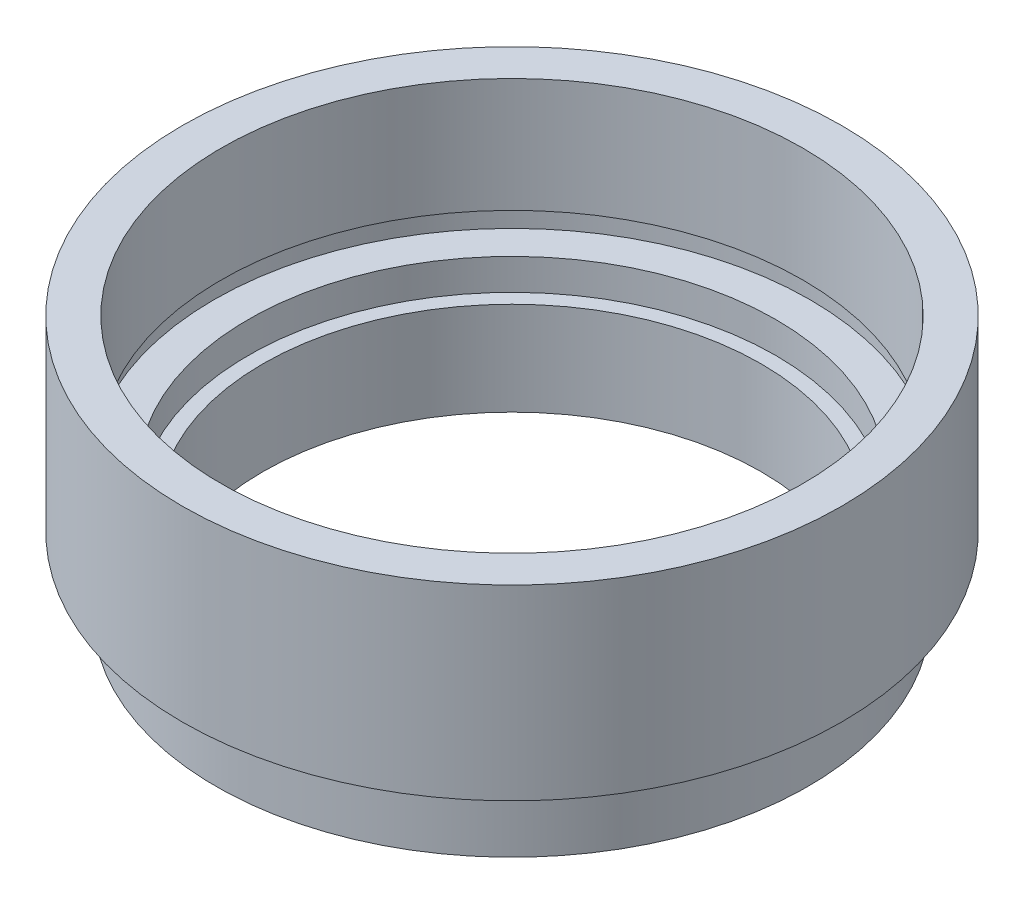
ISO-10303-21;
HEADER;
FILE_DESCRIPTION(('STEP AP214'),'2;1');
FILE_NAME('part.step','',(''),(''),'','','');
FILE_SCHEMA(('AUTOMOTIVE_DESIGN { 1 0 10303 214 1 1 1 1 }'));
ENDSEC;
DATA;
#1=APPLICATION_CONTEXT('core data for automotive mechanical design processes');
#2=APPLICATION_PROTOCOL_DEFINITION('international standard','automotive_design',2000,#1);
#3=PRODUCT_CONTEXT('',#1,'mechanical');
#4=PRODUCT('Part','Part','',(#3));
#5=PRODUCT_RELATED_PRODUCT_CATEGORY('part','',(#4));
#6=PRODUCT_DEFINITION_FORMATION('','',#4);
#7=PRODUCT_DEFINITION_CONTEXT('part definition',#1,'design');
#8=PRODUCT_DEFINITION('design','',#6,#7);
#9=PRODUCT_DEFINITION_SHAPE('','',#8);
#10=(LENGTH_UNIT() NAMED_UNIT(*) SI_UNIT(.MILLI.,.METRE.));
#11=(NAMED_UNIT(*) PLANE_ANGLE_UNIT() SI_UNIT($,.RADIAN.));
#12=(NAMED_UNIT(*) SI_UNIT($,.STERADIAN.) SOLID_ANGLE_UNIT());
#13=UNCERTAINTY_MEASURE_WITH_UNIT(LENGTH_MEASURE(1.E-05),#10,'distance_accuracy_value','');
#14=(GEOMETRIC_REPRESENTATION_CONTEXT(3) GLOBAL_UNCERTAINTY_ASSIGNED_CONTEXT((#13)) GLOBAL_UNIT_ASSIGNED_CONTEXT((#10,
#11,#12)) REPRESENTATION_CONTEXT('',''));
#15=CARTESIAN_POINT('',(0.,0.,0.));
#16=DIRECTION('',(0.,0.,1.));
#17=DIRECTION('',(1.,0.,0.));
#18=AXIS2_PLACEMENT_3D('',#15,#16,#17);
#19=CARTESIAN_POINT('',(0.,0.,0.));
#20=DIRECTION('',(0.,-1.,0.));
#21=DIRECTION('',(0.,0.,-1.));
#22=AXIS2_PLACEMENT_3D('',#19,#20,#21);
#23=CYLINDRICAL_SURFACE('',#22,12.);
#24=CARTESIAN_POINT('',(0.,0.,0.));
#25=DIRECTION('',(0.,-1.,0.));
#26=DIRECTION('',(0.,0.,-1.));
#27=AXIS2_PLACEMENT_3D('',#24,#25,#26);
#28=CIRCLE('',#27,12.);
#29=CARTESIAN_POINT('',(0.,0.,-12.));
#30=VERTEX_POINT('',#29);
#31=EDGE_CURVE('E10',#30,#30,#28,.T.);
#32=ORIENTED_EDGE('',*,*,#31,.T.);
#33=EDGE_LOOP('',(#32));
#34=FACE_BOUND('',#33,.T.);
#35=CARTESIAN_POINT('',(0.,4.5,0.));
#36=DIRECTION('',(0.,-1.,0.));
#37=DIRECTION('',(0.,0.,-1.));
#38=AXIS2_PLACEMENT_3D('',#35,#36,#37);
#39=CIRCLE('',#38,12.);
#40=CARTESIAN_POINT('',(0.,4.5,-12.));
#41=VERTEX_POINT('',#40);
#42=EDGE_CURVE('E95',#41,#41,#39,.T.);
#43=ORIENTED_EDGE('',*,*,#42,.F.);
#44=EDGE_LOOP('',(#43));
#45=FACE_BOUND('',#44,.T.);
#46=ADVANCED_FACE('F36',(#34,#45),#23,.F.);
#47=CARTESIAN_POINT('',(12.,0.,0.));
#48=DIRECTION('',(0.,-1.,0.));
#49=DIRECTION('',(0.,0.,-1.));
#50=AXIS2_PLACEMENT_3D('',#47,#48,#49);
#51=PLANE('',#50);
#52=CARTESIAN_POINT('',(0.,0.,0.));
#53=DIRECTION('',(0.,-1.,0.));
#54=DIRECTION('',(0.,0.,-1.));
#55=AXIS2_PLACEMENT_3D('',#52,#53,#54);
#56=CIRCLE('',#55,14.25);
#57=CARTESIAN_POINT('',(0.,0.,-14.25));
#58=VERTEX_POINT('',#57);
#59=EDGE_CURVE('E43',#58,#58,#56,.T.);
#60=ORIENTED_EDGE('',*,*,#59,.T.);
#61=EDGE_LOOP('',(#60));
#62=FACE_BOUND('',#61,.T.);
#63=ORIENTED_EDGE('',*,*,#31,.F.);
#64=EDGE_LOOP('',(#63));
#65=FACE_BOUND('',#64,.T.);
#66=ADVANCED_FACE('F104',(#62,#65),#51,.T.);
#67=CARTESIAN_POINT('',(0.,0.,0.));
#68=DIRECTION('',(0.,-1.,0.));
#69=DIRECTION('',(0.,0.,-1.));
#70=AXIS2_PLACEMENT_3D('',#67,#68,#69);
#71=CYLINDRICAL_SURFACE('',#70,14.25);
#72=CARTESIAN_POINT('',(0.,2.5,0.));
#73=DIRECTION('',(0.,-1.,0.));
#74=DIRECTION('',(0.,0.,-1.));
#75=AXIS2_PLACEMENT_3D('',#72,#73,#74);
#76=CIRCLE('',#75,14.25);
#77=CARTESIAN_POINT('',(0.,2.5,-14.25));
#78=VERTEX_POINT('',#77);
#79=EDGE_CURVE('E50',#78,#78,#76,.T.);
#80=ORIENTED_EDGE('',*,*,#79,.T.);
#81=EDGE_LOOP('',(#80));
#82=FACE_BOUND('',#81,.T.);
#83=ORIENTED_EDGE('',*,*,#59,.F.);
#84=EDGE_LOOP('',(#83));
#85=FACE_BOUND('',#84,.T.);
#86=ADVANCED_FACE('F108',(#82,#85),#71,.T.);
#87=CARTESIAN_POINT('',(14.25,2.5,0.));
#88=DIRECTION('',(0.,1.,0.));
#89=DIRECTION('',(0.,0.,1.));
#90=AXIS2_PLACEMENT_3D('',#87,#88,#89);
#91=PLANE('',#90);
#92=CARTESIAN_POINT('',(0.,2.5,0.));
#93=DIRECTION('',(0.,-1.,0.));
#94=DIRECTION('',(0.,0.,-1.));
#95=AXIS2_PLACEMENT_3D('',#92,#93,#94);
#96=CIRCLE('',#95,13.75);
#97=CARTESIAN_POINT('',(0.,2.5,-13.75));
#98=VERTEX_POINT('',#97);
#99=EDGE_CURVE('E56',#98,#98,#96,.T.);
#100=ORIENTED_EDGE('',*,*,#99,.T.);
#101=EDGE_LOOP('',(#100));
#102=FACE_BOUND('',#101,.T.);
#103=ORIENTED_EDGE('',*,*,#79,.F.);
#104=EDGE_LOOP('',(#103));
#105=FACE_BOUND('',#104,.T.);
#106=ADVANCED_FACE('F112',(#102,#105),#91,.T.);
#107=CARTESIAN_POINT('',(0.,0.,0.));
#108=DIRECTION('',(0.,-1.,0.));
#109=DIRECTION('',(0.,0.,-1.));
#110=AXIS2_PLACEMENT_3D('',#107,#108,#109);
#111=CYLINDRICAL_SURFACE('',#110,13.75);
#112=CARTESIAN_POINT('',(0.,3.5,0.));
#113=DIRECTION('',(0.,-1.,0.));
#114=DIRECTION('',(0.,0.,-1.));
#115=AXIS2_PLACEMENT_3D('',#112,#113,#114);
#116=CIRCLE('',#115,13.75);
#117=CARTESIAN_POINT('',(0.,3.5,-13.75));
#118=VERTEX_POINT('',#117);
#119=EDGE_CURVE('E62',#118,#118,#116,.T.);
#120=ORIENTED_EDGE('',*,*,#119,.T.);
#121=EDGE_LOOP('',(#120));
#122=FACE_BOUND('',#121,.T.);
#123=ORIENTED_EDGE('',*,*,#99,.F.);
#124=EDGE_LOOP('',(#123));
#125=FACE_BOUND('',#124,.T.);
#126=ADVANCED_FACE('F119',(#122,#125),#111,.T.);
#127=CARTESIAN_POINT('',(13.75,3.5,0.));
#128=DIRECTION('',(0.,-1.,0.));
#129=DIRECTION('',(0.,0.,-1.));
#130=AXIS2_PLACEMENT_3D('',#127,#128,#129);
#131=PLANE('',#130);
#132=CARTESIAN_POINT('',(0.,3.5,0.));
#133=DIRECTION('',(0.,-1.,0.));
#134=DIRECTION('',(0.,0.,-1.));
#135=AXIS2_PLACEMENT_3D('',#132,#133,#134);
#136=CIRCLE('',#135,15.875);
#137=CARTESIAN_POINT('',(0.,3.5,-15.875));
#138=VERTEX_POINT('',#137);
#139=EDGE_CURVE('E66',#138,#138,#136,.T.);
#140=ORIENTED_EDGE('',*,*,#139,.T.);
#141=EDGE_LOOP('',(#140));
#142=FACE_BOUND('',#141,.T.);
#143=ORIENTED_EDGE('',*,*,#119,.F.);
#144=EDGE_LOOP('',(#143));
#145=FACE_BOUND('',#144,.T.);
#146=ADVANCED_FACE('F123',(#142,#145),#131,.T.);
#147=CARTESIAN_POINT('',(0.,0.,0.));
#148=DIRECTION('',(0.,-1.,0.));
#149=DIRECTION('',(0.,0.,-1.));
#150=AXIS2_PLACEMENT_3D('',#147,#148,#149);
#151=CYLINDRICAL_SURFACE('',#150,15.875);
#152=CARTESIAN_POINT('',(0.,12.5,0.));
#153=DIRECTION('',(0.,-1.,0.));
#154=DIRECTION('',(0.,0.,-1.));
#155=AXIS2_PLACEMENT_3D('',#152,#153,#154);
#156=CIRCLE('',#155,15.875);
#157=CARTESIAN_POINT('',(0.,12.5,-15.875));
#158=VERTEX_POINT('',#157);
#159=EDGE_CURVE('E70',#158,#158,#156,.T.);
#160=ORIENTED_EDGE('',*,*,#159,.T.);
#161=EDGE_LOOP('',(#160));
#162=FACE_BOUND('',#161,.T.);
#163=ORIENTED_EDGE('',*,*,#139,.F.);
#164=EDGE_LOOP('',(#163));
#165=FACE_BOUND('',#164,.T.);
#166=ADVANCED_FACE('F127',(#162,#165),#151,.T.);
#167=CARTESIAN_POINT('',(15.875,12.5,0.));
#168=DIRECTION('',(0.,1.,0.));
#169=DIRECTION('',(0.,0.,1.));
#170=AXIS2_PLACEMENT_3D('',#167,#168,#169);
#171=PLANE('',#170);
#172=CARTESIAN_POINT('',(0.,12.5,0.));
#173=DIRECTION('',(0.,-1.,0.));
#174=DIRECTION('',(0.,0.,-1.));
#175=AXIS2_PLACEMENT_3D('',#172,#173,#174);
#176=CIRCLE('',#175,14.);
#177=CARTESIAN_POINT('',(0.,12.5,-14.));
#178=VERTEX_POINT('',#177);
#179=EDGE_CURVE('E73',#178,#178,#176,.T.);
#180=ORIENTED_EDGE('',*,*,#179,.T.);
#181=EDGE_LOOP('',(#180));
#182=FACE_BOUND('',#181,.T.);
#183=ORIENTED_EDGE('',*,*,#159,.F.);
#184=EDGE_LOOP('',(#183));
#185=FACE_BOUND('',#184,.T.);
#186=ADVANCED_FACE('F131',(#182,#185),#171,.T.);
#187=CARTESIAN_POINT('',(0.,0.,0.));
#188=DIRECTION('',(0.,-1.,0.));
#189=DIRECTION('',(0.,0.,-1.));
#190=AXIS2_PLACEMENT_3D('',#187,#188,#189);
#191=CYLINDRICAL_SURFACE('',#190,14.);
#192=CARTESIAN_POINT('',(0.,7.,0.));
#193=DIRECTION('',(0.,-1.,0.));
#194=DIRECTION('',(0.,0.,-1.));
#195=AXIS2_PLACEMENT_3D('',#192,#193,#194);
#196=CIRCLE('',#195,14.);
#197=CARTESIAN_POINT('',(0.,7.,-14.));
#198=VERTEX_POINT('',#197);
#199=EDGE_CURVE('E77',#198,#198,#196,.T.);
#200=ORIENTED_EDGE('',*,*,#199,.T.);
#201=EDGE_LOOP('',(#200));
#202=FACE_BOUND('',#201,.T.);
#203=ORIENTED_EDGE('',*,*,#179,.F.);
#204=EDGE_LOOP('',(#203));
#205=FACE_BOUND('',#204,.T.);
#206=ADVANCED_FACE('F135',(#202,#205),#191,.F.);
#207=CARTESIAN_POINT('',(14.,7.,0.));
#208=DIRECTION('',(0.,-1.,0.));
#209=DIRECTION('',(0.,0.,-1.));
#210=AXIS2_PLACEMENT_3D('',#207,#208,#209);
#211=PLANE('',#210);
#212=CARTESIAN_POINT('',(0.,7.,0.));
#213=DIRECTION('',(0.,-1.,0.));
#214=DIRECTION('',(0.,0.,-1.));
#215=AXIS2_PLACEMENT_3D('',#212,#213,#214);
#216=CIRCLE('',#215,14.35);
#217=CARTESIAN_POINT('',(0.,7.,-14.35));
#218=VERTEX_POINT('',#217);
#219=EDGE_CURVE('E81',#218,#218,#216,.T.);
#220=ORIENTED_EDGE('',*,*,#219,.T.);
#221=EDGE_LOOP('',(#220));
#222=FACE_BOUND('',#221,.T.);
#223=ORIENTED_EDGE('',*,*,#199,.F.);
#224=EDGE_LOOP('',(#223));
#225=FACE_BOUND('',#224,.T.);
#226=ADVANCED_FACE('F139',(#222,#225),#211,.T.);
#227=CARTESIAN_POINT('',(0.,0.,0.));
#228=DIRECTION('',(0.,-1.,0.));
#229=DIRECTION('',(0.,0.,-1.));
#230=AXIS2_PLACEMENT_3D('',#227,#228,#229);
#231=CYLINDRICAL_SURFACE('',#230,14.35);
#232=CARTESIAN_POINT('',(0.,6.,0.));
#233=DIRECTION('',(0.,-1.,0.));
#234=DIRECTION('',(0.,0.,-1.));
#235=AXIS2_PLACEMENT_3D('',#232,#233,#234);
#236=CIRCLE('',#235,14.35);
#237=CARTESIAN_POINT('',(0.,6.,-14.35));
#238=VERTEX_POINT('',#237);
#239=EDGE_CURVE('E85',#238,#238,#236,.T.);
#240=ORIENTED_EDGE('',*,*,#239,.T.);
#241=EDGE_LOOP('',(#240));
#242=FACE_BOUND('',#241,.T.);
#243=ORIENTED_EDGE('',*,*,#219,.F.);
#244=EDGE_LOOP('',(#243));
#245=FACE_BOUND('',#244,.T.);
#246=ADVANCED_FACE('F143',(#242,#245),#231,.F.);
#247=CARTESIAN_POINT('',(14.35,6.,0.));
#248=DIRECTION('',(0.,1.,0.));
#249=DIRECTION('',(0.,0.,1.));
#250=AXIS2_PLACEMENT_3D('',#247,#248,#249);
#251=PLANE('',#250);
#252=CARTESIAN_POINT('',(0.,6.,0.));
#253=DIRECTION('',(0.,-1.,0.));
#254=DIRECTION('',(0.,0.,-1.));
#255=AXIS2_PLACEMENT_3D('',#252,#253,#254);
#256=CIRCLE('',#255,12.7);
#257=CARTESIAN_POINT('',(0.,6.,-12.7));
#258=VERTEX_POINT('',#257);
#259=EDGE_CURVE('E88',#258,#258,#256,.T.);
#260=ORIENTED_EDGE('',*,*,#259,.T.);
#261=EDGE_LOOP('',(#260));
#262=FACE_BOUND('',#261,.T.);
#263=ORIENTED_EDGE('',*,*,#239,.F.);
#264=EDGE_LOOP('',(#263));
#265=FACE_BOUND('',#264,.T.);
#266=ADVANCED_FACE('F147',(#262,#265),#251,.T.);
#267=CARTESIAN_POINT('',(0.,0.,0.));
#268=DIRECTION('',(0.,-1.,0.));
#269=DIRECTION('',(0.,0.,-1.));
#270=AXIS2_PLACEMENT_3D('',#267,#268,#269);
#271=CYLINDRICAL_SURFACE('',#270,12.7);
#272=CARTESIAN_POINT('',(0.,4.5,0.));
#273=DIRECTION('',(0.,-1.,0.));
#274=DIRECTION('',(0.,0.,-1.));
#275=AXIS2_PLACEMENT_3D('',#272,#273,#274);
#276=CIRCLE('',#275,12.7);
#277=CARTESIAN_POINT('',(0.,4.5,-12.7));
#278=VERTEX_POINT('',#277);
#279=EDGE_CURVE('E91',#278,#278,#276,.T.);
#280=ORIENTED_EDGE('',*,*,#279,.T.);
#281=EDGE_LOOP('',(#280));
#282=FACE_BOUND('',#281,.T.);
#283=ORIENTED_EDGE('',*,*,#259,.F.);
#284=EDGE_LOOP('',(#283));
#285=FACE_BOUND('',#284,.T.);
#286=ADVANCED_FACE('F151',(#282,#285),#271,.F.);
#287=CARTESIAN_POINT('',(12.7,4.5,0.));
#288=DIRECTION('',(0.,1.,0.));
#289=DIRECTION('',(0.,0.,1.));
#290=AXIS2_PLACEMENT_3D('',#287,#288,#289);
#291=PLANE('',#290);
#292=ORIENTED_EDGE('',*,*,#42,.T.);
#293=EDGE_LOOP('',(#292));
#294=FACE_BOUND('',#293,.T.);
#295=ORIENTED_EDGE('',*,*,#279,.F.);
#296=EDGE_LOOP('',(#295));
#297=FACE_BOUND('',#296,.T.);
#298=ADVANCED_FACE('F100',(#294,#297),#291,.T.);
#299=CLOSED_SHELL('',(#46,#66,#86,#106,#126,#146,#166,#186,#206,#226,#246,#266,#286,#298));
#300=MANIFOLD_SOLID_BREP('B2',#299);
#301=ADVANCED_BREP_SHAPE_REPRESENTATION('',(#18,#300),#14);
#302=SHAPE_DEFINITION_REPRESENTATION(#9,#301);
ENDSEC;
END-ISO-10303-21;
